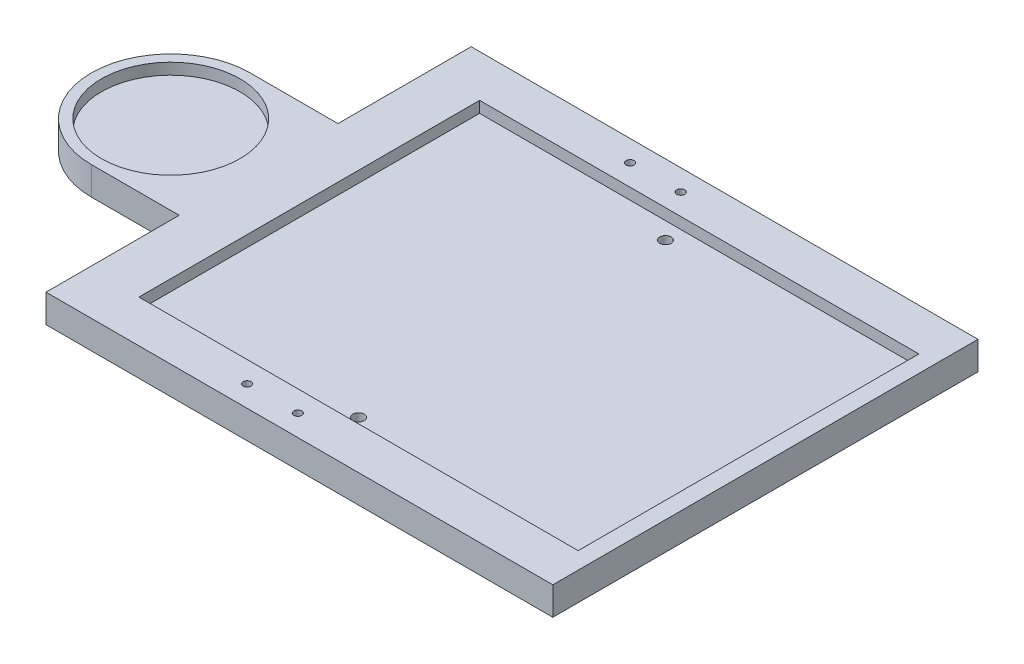
ISO-10303-21;
HEADER;
FILE_DESCRIPTION(('STEP AP214'),'2;1');
FILE_NAME('part.step','',(''),(''),'','','');
FILE_SCHEMA(('AUTOMOTIVE_DESIGN { 1 0 10303 214 1 1 1 1 }'));
ENDSEC;
DATA;
#1=APPLICATION_CONTEXT('core data for automotive mechanical design processes');
#2=APPLICATION_PROTOCOL_DEFINITION('international standard','automotive_design',2000,#1);
#3=PRODUCT_CONTEXT('',#1,'mechanical');
#4=PRODUCT('Part','Part','',(#3));
#5=PRODUCT_RELATED_PRODUCT_CATEGORY('part','',(#4));
#6=PRODUCT_DEFINITION_FORMATION('','',#4);
#7=PRODUCT_DEFINITION_CONTEXT('part definition',#1,'design');
#8=PRODUCT_DEFINITION('design','',#6,#7);
#9=PRODUCT_DEFINITION_SHAPE('','',#8);
#10=(LENGTH_UNIT() NAMED_UNIT(*) SI_UNIT(.MILLI.,.METRE.));
#11=(NAMED_UNIT(*) PLANE_ANGLE_UNIT() SI_UNIT($,.RADIAN.));
#12=(NAMED_UNIT(*) SI_UNIT($,.STERADIAN.) SOLID_ANGLE_UNIT());
#13=UNCERTAINTY_MEASURE_WITH_UNIT(LENGTH_MEASURE(1.E-05),#10,'distance_accuracy_value','');
#14=(GEOMETRIC_REPRESENTATION_CONTEXT(3) GLOBAL_UNCERTAINTY_ASSIGNED_CONTEXT((#13)) GLOBAL_UNIT_ASSIGNED_CONTEXT((#10,
#11,#12)) REPRESENTATION_CONTEXT('',''));
#15=CARTESIAN_POINT('',(0.,0.,0.));
#16=DIRECTION('',(0.,0.,1.));
#17=DIRECTION('',(1.,0.,0.));
#18=AXIS2_PLACEMENT_3D('',#15,#16,#17);
#19=CARTESIAN_POINT('',(0.,25.,0.));
#20=DIRECTION('',(0.,1.,0.));
#21=DIRECTION('',(0.,0.,1.));
#22=AXIS2_PLACEMENT_3D('',#19,#20,#21);
#23=PLANE('',#22);
#24=CARTESIAN_POINT('',(159.81,25.,-170.));
#25=DIRECTION('',(0.,1.,0.));
#26=DIRECTION('',(0.,0.,-1.));
#27=AXIS2_PLACEMENT_3D('',#24,#25,#26);
#28=CIRCLE('',#27,3.49999999999999);
#29=CARTESIAN_POINT('',(159.81,25.,-173.5));
#30=VERTEX_POINT('',#29);
#31=EDGE_CURVE('E563',#30,#30,#28,.T.);
#32=ORIENTED_EDGE('',*,*,#31,.F.);
#33=EDGE_LOOP('',(#32));
#34=FACE_BOUND('',#33,.T.);
#35=CARTESIAN_POINT('',(204.81,25.,-170.));
#36=DIRECTION('',(0.,1.,0.));
#37=DIRECTION('',(0.,0.,-1.));
#38=AXIS2_PLACEMENT_3D('',#35,#36,#37);
#39=CIRCLE('',#38,3.50000000000002);
#40=CARTESIAN_POINT('',(204.81,25.,-173.5));
#41=VERTEX_POINT('',#40);
#42=EDGE_CURVE('E565',#41,#41,#39,.T.);
#43=ORIENTED_EDGE('',*,*,#42,.F.);
#44=EDGE_LOOP('',(#43));
#45=FACE_BOUND('',#44,.T.);
#46=CARTESIAN_POINT('',(204.81,25.,170.));
#47=DIRECTION('',(0.,1.,0.));
#48=DIRECTION('',(0.,0.,1.));
#49=AXIS2_PLACEMENT_3D('',#46,#47,#48);
#50=CIRCLE('',#49,3.50000000000002);
#51=CARTESIAN_POINT('',(204.81,25.,173.5));
#52=VERTEX_POINT('',#51);
#53=EDGE_CURVE('E577',#52,#52,#50,.T.);
#54=ORIENTED_EDGE('',*,*,#53,.F.);
#55=EDGE_LOOP('',(#54));
#56=FACE_BOUND('',#55,.T.);
#57=CARTESIAN_POINT('',(159.81,25.,170.));
#58=DIRECTION('',(0.,1.,0.));
#59=DIRECTION('',(0.,0.,1.));
#60=AXIS2_PLACEMENT_3D('',#57,#58,#59);
#61=CIRCLE('',#60,3.49999999999999);
#62=CARTESIAN_POINT('',(159.81,25.,173.5));
#63=VERTEX_POINT('',#62);
#64=EDGE_CURVE('E571',#63,#63,#61,.T.);
#65=ORIENTED_EDGE('',*,*,#64,.F.);
#66=EDGE_LOOP('',(#65));
#67=FACE_BOUND('',#66,.T.);
#68=DIRECTION('',(0.,0.,-1.));
#69=VECTOR('',#68,1.);
#70=CARTESIAN_POINT('',(45.,25.,151.25));
#71=LINE('',#70,#69);
#72=CARTESIAN_POINT('',(45.,25.,151.25));
#73=VERTEX_POINT('',#72);
#74=CARTESIAN_POINT('',(45.,25.,-151.25));
#75=VERTEX_POINT('',#74);
#76=EDGE_CURVE('E240',#73,#75,#71,.T.);
#77=ORIENTED_EDGE('',*,*,#76,.T.);
#78=DIRECTION('',(-1.,0.,0.));
#79=VECTOR('',#78,1.);
#80=CARTESIAN_POINT('',(435.,25.,-151.25));
#81=LINE('',#80,#79);
#82=CARTESIAN_POINT('',(435.,25.,-151.25));
#83=VERTEX_POINT('',#82);
#84=EDGE_CURVE('E238',#83,#75,#81,.T.);
#85=ORIENTED_EDGE('',*,*,#84,.F.);
#86=DIRECTION('',(0.,0.,-1.));
#87=VECTOR('',#86,1.);
#88=CARTESIAN_POINT('',(435.,25.,151.25));
#89=LINE('',#88,#87);
#90=CARTESIAN_POINT('',(435.,25.,151.25));
#91=VERTEX_POINT('',#90);
#92=EDGE_CURVE('E205',#91,#83,#89,.T.);
#93=ORIENTED_EDGE('',*,*,#92,.F.);
#94=DIRECTION('',(-1.,0.,0.));
#95=VECTOR('',#94,1.);
#96=CARTESIAN_POINT('',(435.,25.,151.25));
#97=LINE('',#96,#95);
#98=EDGE_CURVE('E243',#91,#73,#97,.T.);
#99=ORIENTED_EDGE('',*,*,#98,.T.);
#100=EDGE_LOOP('',(#77,#85,#93,#99));
#101=FACE_BOUND('',#100,.T.);
#102=CARTESIAN_POINT('',(-78.,25.,0.));
#103=DIRECTION('',(0.,1.,0.));
#104=DIRECTION('',(0.,0.,1.));
#105=AXIS2_PLACEMENT_3D('',#102,#103,#104);
#106=CIRCLE('',#105,70.5);
#107=CARTESIAN_POINT('',(-78.,25.,70.5));
#108=VERTEX_POINT('',#107);
#109=CARTESIAN_POINT('',(-78.,25.,-70.5));
#110=VERTEX_POINT('',#109);
#111=EDGE_CURVE('E252',#108,#110,#106,.F.);
#112=ORIENTED_EDGE('',*,*,#111,.F.);
#113=DIRECTION('',(-1.,0.,0.));
#114=VECTOR('',#113,1.);
#115=CARTESIAN_POINT('',(0.,25.,70.5));
#116=LINE('',#115,#114);
#117=CARTESIAN_POINT('',(0.,25.,70.5));
#118=VERTEX_POINT('',#117);
#119=EDGE_CURVE('E255',#118,#108,#116,.T.);
#120=ORIENTED_EDGE('',*,*,#119,.F.);
#121=DIRECTION('',(0.,0.,-1.));
#122=VECTOR('',#121,1.);
#123=CARTESIAN_POINT('',(0.,25.,0.));
#124=LINE('',#123,#122);
#125=CARTESIAN_POINT('',(0.,25.,188.75));
#126=VERTEX_POINT('',#125);
#127=EDGE_CURVE('E258',#126,#118,#124,.T.);
#128=ORIENTED_EDGE('',*,*,#127,.F.);
#129=DIRECTION('',(-1.,0.,0.));
#130=VECTOR('',#129,1.);
#131=CARTESIAN_POINT('',(0.,25.,188.75));
#132=LINE('',#131,#130);
#133=CARTESIAN_POINT('',(450.,25.,188.75));
#134=VERTEX_POINT('',#133);
#135=EDGE_CURVE('E262',#134,#126,#132,.T.);
#136=ORIENTED_EDGE('',*,*,#135,.F.);
#137=DIRECTION('',(0.,0.,1.));
#138=VECTOR('',#137,1.);
#139=CARTESIAN_POINT('',(450.,25.,0.));
#140=LINE('',#139,#138);
#141=CARTESIAN_POINT('',(450.,25.,-188.75));
#142=VERTEX_POINT('',#141);
#143=EDGE_CURVE('E265',#142,#134,#140,.T.);
#144=ORIENTED_EDGE('',*,*,#143,.F.);
#145=DIRECTION('',(1.,0.,0.));
#146=VECTOR('',#145,1.);
#147=CARTESIAN_POINT('',(0.,25.,-188.75));
#148=LINE('',#147,#146);
#149=CARTESIAN_POINT('',(0.,25.,-188.75));
#150=VERTEX_POINT('',#149);
#151=EDGE_CURVE('E268',#150,#142,#148,.T.);
#152=ORIENTED_EDGE('',*,*,#151,.F.);
#153=DIRECTION('',(0.,0.,-1.));
#154=VECTOR('',#153,1.);
#155=CARTESIAN_POINT('',(0.,25.,0.));
#156=LINE('',#155,#154);
#157=CARTESIAN_POINT('',(0.,25.,-70.5));
#158=VERTEX_POINT('',#157);
#159=EDGE_CURVE('E271',#158,#150,#156,.T.);
#160=ORIENTED_EDGE('',*,*,#159,.F.);
#161=DIRECTION('',(1.,0.,0.));
#162=VECTOR('',#161,1.);
#163=CARTESIAN_POINT('',(0.,25.,-70.5));
#164=LINE('',#163,#162);
#165=EDGE_CURVE('E274',#110,#158,#164,.T.);
#166=ORIENTED_EDGE('',*,*,#165,.F.);
#167=EDGE_LOOP('',(#112,#120,#128,#136,#144,#152,#160,#166));
#168=FACE_BOUND('',#167,.T.);
#169=CARTESIAN_POINT('',(-78.,25.,0.));
#170=DIRECTION('',(0.,1.,0.));
#171=DIRECTION('',(0.,0.,1.));
#172=AXIS2_PLACEMENT_3D('',#169,#170,#171);
#173=CIRCLE('',#172,61.5);
#174=CARTESIAN_POINT('',(-78.,25.,61.5));
#175=VERTEX_POINT('',#174);
#176=EDGE_CURVE('E228',#175,#175,#173,.T.);
#177=ORIENTED_EDGE('',*,*,#176,.F.);
#178=EDGE_LOOP('',(#177));
#179=FACE_BOUND('',#178,.T.);
#180=ADVANCED_FACE('F108',(#34,#45,#56,#67,#101,#168,#179),#23,.T.);
#181=CARTESIAN_POINT('',(0.,0.,0.));
#182=DIRECTION('',(0.,1.,0.));
#183=DIRECTION('',(0.,0.,1.));
#184=AXIS2_PLACEMENT_3D('',#181,#182,#183);
#185=PLANE('',#184);
#186=CARTESIAN_POINT('',(159.81,0.,-170.));
#187=DIRECTION('',(0.,1.,0.));
#188=DIRECTION('',(0.,0.,-1.));
#189=AXIS2_PLACEMENT_3D('',#186,#187,#188);
#190=CIRCLE('',#189,3.49999999999999);
#191=CARTESIAN_POINT('',(159.81,0.,-173.5));
#192=VERTEX_POINT('',#191);
#193=EDGE_CURVE('E561',#192,#192,#190,.T.);
#194=ORIENTED_EDGE('',*,*,#193,.T.);
#195=EDGE_LOOP('',(#194));
#196=FACE_BOUND('',#195,.T.);
#197=CARTESIAN_POINT('',(204.81,0.,-170.));
#198=DIRECTION('',(0.,1.,0.));
#199=DIRECTION('',(0.,0.,-1.));
#200=AXIS2_PLACEMENT_3D('',#197,#198,#199);
#201=CIRCLE('',#200,3.50000000000002);
#202=CARTESIAN_POINT('',(204.81,0.,-173.5));
#203=VERTEX_POINT('',#202);
#204=EDGE_CURVE('E582',#203,#203,#201,.T.);
#205=ORIENTED_EDGE('',*,*,#204,.T.);
#206=EDGE_LOOP('',(#205));
#207=FACE_BOUND('',#206,.T.);
#208=CARTESIAN_POINT('',(204.81,0.,170.));
#209=DIRECTION('',(0.,1.,0.));
#210=DIRECTION('',(0.,0.,1.));
#211=AXIS2_PLACEMENT_3D('',#208,#209,#210);
#212=CIRCLE('',#211,3.50000000000002);
#213=CARTESIAN_POINT('',(204.81,0.,173.5));
#214=VERTEX_POINT('',#213);
#215=EDGE_CURVE('E573',#214,#214,#212,.T.);
#216=ORIENTED_EDGE('',*,*,#215,.T.);
#217=EDGE_LOOP('',(#216));
#218=FACE_BOUND('',#217,.T.);
#219=CARTESIAN_POINT('',(159.81,0.,170.));
#220=DIRECTION('',(0.,1.,0.));
#221=DIRECTION('',(0.,0.,1.));
#222=AXIS2_PLACEMENT_3D('',#219,#220,#221);
#223=CIRCLE('',#222,3.49999999999999);
#224=CARTESIAN_POINT('',(159.81,0.,173.5));
#225=VERTEX_POINT('',#224);
#226=EDGE_CURVE('E233',#225,#225,#223,.T.);
#227=ORIENTED_EDGE('',*,*,#226,.T.);
#228=EDGE_LOOP('',(#227));
#229=FACE_BOUND('',#228,.T.);
#230=CARTESIAN_POINT('',(-78.,0.,0.));
#231=DIRECTION('',(0.,1.,0.));
#232=DIRECTION('',(0.,0.,1.));
#233=AXIS2_PLACEMENT_3D('',#230,#231,#232);
#234=CIRCLE('',#233,70.5);
#235=CARTESIAN_POINT('',(-78.,0.,70.5));
#236=VERTEX_POINT('',#235);
#237=CARTESIAN_POINT('',(-78.,0.,-70.5));
#238=VERTEX_POINT('',#237);
#239=EDGE_CURVE('E251',#236,#238,#234,.F.);
#240=ORIENTED_EDGE('',*,*,#239,.T.);
#241=DIRECTION('',(1.,0.,0.));
#242=VECTOR('',#241,1.);
#243=CARTESIAN_POINT('',(0.,0.,-70.5));
#244=LINE('',#243,#242);
#245=CARTESIAN_POINT('',(0.,0.,-70.5));
#246=VERTEX_POINT('',#245);
#247=EDGE_CURVE('E256',#238,#246,#244,.T.);
#248=ORIENTED_EDGE('',*,*,#247,.T.);
#249=DIRECTION('',(0.,0.,-1.));
#250=VECTOR('',#249,1.);
#251=CARTESIAN_POINT('',(0.,0.,0.));
#252=LINE('',#251,#250);
#253=CARTESIAN_POINT('',(0.,0.,-188.75));
#254=VERTEX_POINT('',#253);
#255=EDGE_CURVE('E295',#246,#254,#252,.T.);
#256=ORIENTED_EDGE('',*,*,#255,.T.);
#257=DIRECTION('',(1.,0.,0.));
#258=VECTOR('',#257,1.);
#259=CARTESIAN_POINT('',(0.,0.,-188.75));
#260=LINE('',#259,#258);
#261=CARTESIAN_POINT('',(450.,0.,-188.75));
#262=VERTEX_POINT('',#261);
#263=EDGE_CURVE('E292',#254,#262,#260,.T.);
#264=ORIENTED_EDGE('',*,*,#263,.T.);
#265=DIRECTION('',(0.,0.,1.));
#266=VECTOR('',#265,1.);
#267=CARTESIAN_POINT('',(450.,0.,0.));
#268=LINE('',#267,#266);
#269=CARTESIAN_POINT('',(450.,0.,188.75));
#270=VERTEX_POINT('',#269);
#271=EDGE_CURVE('E289',#262,#270,#268,.T.);
#272=ORIENTED_EDGE('',*,*,#271,.T.);
#273=DIRECTION('',(-1.,0.,0.));
#274=VECTOR('',#273,1.);
#275=CARTESIAN_POINT('',(0.,0.,188.75));
#276=LINE('',#275,#274);
#277=CARTESIAN_POINT('',(0.,0.,188.75));
#278=VERTEX_POINT('',#277);
#279=EDGE_CURVE('E286',#270,#278,#276,.T.);
#280=ORIENTED_EDGE('',*,*,#279,.T.);
#281=DIRECTION('',(0.,0.,-1.));
#282=VECTOR('',#281,1.);
#283=CARTESIAN_POINT('',(0.,0.,0.));
#284=LINE('',#283,#282);
#285=CARTESIAN_POINT('',(0.,0.,70.5));
#286=VERTEX_POINT('',#285);
#287=EDGE_CURVE('E283',#278,#286,#284,.T.);
#288=ORIENTED_EDGE('',*,*,#287,.T.);
#289=DIRECTION('',(-1.,0.,0.));
#290=VECTOR('',#289,1.);
#291=CARTESIAN_POINT('',(0.,0.,70.5));
#292=LINE('',#291,#290);
#293=EDGE_CURVE('E280',#286,#236,#292,.T.);
#294=ORIENTED_EDGE('',*,*,#293,.T.);
#295=EDGE_LOOP('',(#240,#248,#256,#264,#272,#280,#288,#294));
#296=FACE_BOUND('',#295,.T.);
#297=CARTESIAN_POINT('',(225.,0.,-136.25));
#298=DIRECTION('',(0.,1.,0.));
#299=DIRECTION('',(0.,0.,1.));
#300=AXIS2_PLACEMENT_3D('',#297,#298,#299);
#301=CIRCLE('',#300,5.00000000000002);
#302=CARTESIAN_POINT('',(225.,0.,-131.25));
#303=VERTEX_POINT('',#302);
#304=EDGE_CURVE('E229',#303,#303,#301,.T.);
#305=ORIENTED_EDGE('',*,*,#304,.T.);
#306=EDGE_LOOP('',(#305));
#307=FACE_BOUND('',#306,.T.);
#308=CARTESIAN_POINT('',(225.,0.,136.25));
#309=DIRECTION('',(0.,1.,0.));
#310=DIRECTION('',(0.,0.,1.));
#311=AXIS2_PLACEMENT_3D('',#308,#309,#310);
#312=CIRCLE('',#311,5.00000000000002);
#313=CARTESIAN_POINT('',(225.,0.,141.25));
#314=VERTEX_POINT('',#313);
#315=EDGE_CURVE('E232',#314,#314,#312,.F.);
#316=ORIENTED_EDGE('',*,*,#315,.F.);
#317=EDGE_LOOP('',(#316));
#318=FACE_BOUND('',#317,.T.);
#319=ADVANCED_FACE('F321',(#196,#207,#218,#229,#296,#307,#318),#185,.F.);
#320=CARTESIAN_POINT('',(-78.,25.,0.));
#321=DIRECTION('',(0.,-1.,0.));
#322=DIRECTION('',(0.,0.,-1.));
#323=AXIS2_PLACEMENT_3D('',#320,#321,#322);
#324=CYLINDRICAL_SURFACE('',#323,70.5);
#325=ORIENTED_EDGE('',*,*,#239,.F.);
#326=DIRECTION('',(0.,-1.,0.));
#327=VECTOR('',#326,1.);
#328=CARTESIAN_POINT('',(-78.,25.,70.5));
#329=LINE('',#328,#327);
#330=EDGE_CURVE('E116',#108,#236,#329,.T.);
#331=ORIENTED_EDGE('',*,*,#330,.F.);
#332=ORIENTED_EDGE('',*,*,#111,.T.);
#333=DIRECTION('',(0.,-1.,0.));
#334=VECTOR('',#333,1.);
#335=CARTESIAN_POINT('',(-78.,25.,-70.5));
#336=LINE('',#335,#334);
#337=EDGE_CURVE('E277',#110,#238,#336,.T.);
#338=ORIENTED_EDGE('',*,*,#337,.T.);
#339=EDGE_LOOP('',(#325,#331,#332,#338));
#340=FACE_BOUND('',#339,.T.);
#341=ADVANCED_FACE('F110',(#340),#324,.T.);
#342=CARTESIAN_POINT('',(0.,25.,70.5));
#343=DIRECTION('',(0.,0.,1.));
#344=DIRECTION('',(1.,0.,0.));
#345=AXIS2_PLACEMENT_3D('',#342,#343,#344);
#346=PLANE('',#345);
#347=ORIENTED_EDGE('',*,*,#293,.F.);
#348=DIRECTION('',(0.,-1.,0.));
#349=VECTOR('',#348,1.);
#350=CARTESIAN_POINT('',(0.,25.,70.5));
#351=LINE('',#350,#349);
#352=EDGE_CURVE('E311',#118,#286,#351,.T.);
#353=ORIENTED_EDGE('',*,*,#352,.F.);
#354=ORIENTED_EDGE('',*,*,#119,.T.);
#355=ORIENTED_EDGE('',*,*,#330,.T.);
#356=EDGE_LOOP('',(#347,#353,#354,#355));
#357=FACE_BOUND('',#356,.T.);
#358=ADVANCED_FACE('F315',(#357),#346,.T.);
#359=CARTESIAN_POINT('',(0.,25.,0.));
#360=DIRECTION('',(-1.,0.,0.));
#361=DIRECTION('',(0.,0.,1.));
#362=AXIS2_PLACEMENT_3D('',#359,#360,#361);
#363=PLANE('',#362);
#364=ORIENTED_EDGE('',*,*,#287,.F.);
#365=DIRECTION('',(0.,-1.,0.));
#366=VECTOR('',#365,1.);
#367=CARTESIAN_POINT('',(0.,25.,188.75));
#368=LINE('',#367,#366);
#369=EDGE_CURVE('E309',#126,#278,#368,.T.);
#370=ORIENTED_EDGE('',*,*,#369,.F.);
#371=ORIENTED_EDGE('',*,*,#127,.T.);
#372=ORIENTED_EDGE('',*,*,#352,.T.);
#373=EDGE_LOOP('',(#364,#370,#371,#372));
#374=FACE_BOUND('',#373,.T.);
#375=ADVANCED_FACE('F326',(#374),#363,.T.);
#376=CARTESIAN_POINT('',(0.,25.,188.75));
#377=DIRECTION('',(0.,0.,1.));
#378=DIRECTION('',(1.,0.,0.));
#379=AXIS2_PLACEMENT_3D('',#376,#377,#378);
#380=PLANE('',#379);
#381=ORIENTED_EDGE('',*,*,#279,.F.);
#382=DIRECTION('',(0.,-1.,0.));
#383=VECTOR('',#382,1.);
#384=CARTESIAN_POINT('',(450.,25.,188.75));
#385=LINE('',#384,#383);
#386=EDGE_CURVE('E307',#134,#270,#385,.T.);
#387=ORIENTED_EDGE('',*,*,#386,.F.);
#388=ORIENTED_EDGE('',*,*,#135,.T.);
#389=ORIENTED_EDGE('',*,*,#369,.T.);
#390=EDGE_LOOP('',(#381,#387,#388,#389));
#391=FACE_BOUND('',#390,.T.);
#392=ADVANCED_FACE('F347',(#391),#380,.T.);
#393=CARTESIAN_POINT('',(450.,25.,0.));
#394=DIRECTION('',(1.,0.,0.));
#395=DIRECTION('',(0.,0.,-1.));
#396=AXIS2_PLACEMENT_3D('',#393,#394,#395);
#397=PLANE('',#396);
#398=ORIENTED_EDGE('',*,*,#271,.F.);
#399=DIRECTION('',(0.,-1.,0.));
#400=VECTOR('',#399,1.);
#401=CARTESIAN_POINT('',(450.,25.,-188.75));
#402=LINE('',#401,#400);
#403=EDGE_CURVE('E305',#142,#262,#402,.T.);
#404=ORIENTED_EDGE('',*,*,#403,.F.);
#405=ORIENTED_EDGE('',*,*,#143,.T.);
#406=ORIENTED_EDGE('',*,*,#386,.T.);
#407=EDGE_LOOP('',(#398,#404,#405,#406));
#408=FACE_BOUND('',#407,.T.);
#409=ADVANCED_FACE('F345',(#408),#397,.T.);
#410=CARTESIAN_POINT('',(0.,25.,-188.75));
#411=DIRECTION('',(0.,0.,-1.));
#412=DIRECTION('',(-1.,0.,0.));
#413=AXIS2_PLACEMENT_3D('',#410,#411,#412);
#414=PLANE('',#413);
#415=ORIENTED_EDGE('',*,*,#263,.F.);
#416=DIRECTION('',(0.,-1.,0.));
#417=VECTOR('',#416,1.);
#418=CARTESIAN_POINT('',(0.,25.,-188.75));
#419=LINE('',#418,#417);
#420=EDGE_CURVE('E303',#150,#254,#419,.T.);
#421=ORIENTED_EDGE('',*,*,#420,.F.);
#422=ORIENTED_EDGE('',*,*,#151,.T.);
#423=ORIENTED_EDGE('',*,*,#403,.T.);
#424=EDGE_LOOP('',(#415,#421,#422,#423));
#425=FACE_BOUND('',#424,.T.);
#426=ADVANCED_FACE('F341',(#425),#414,.T.);
#427=CARTESIAN_POINT('',(0.,25.,0.));
#428=DIRECTION('',(-1.,0.,0.));
#429=DIRECTION('',(0.,0.,1.));
#430=AXIS2_PLACEMENT_3D('',#427,#428,#429);
#431=PLANE('',#430);
#432=ORIENTED_EDGE('',*,*,#255,.F.);
#433=DIRECTION('',(0.,-1.,0.));
#434=VECTOR('',#433,1.);
#435=CARTESIAN_POINT('',(0.,25.,-70.5));
#436=LINE('',#435,#434);
#437=EDGE_CURVE('E301',#158,#246,#436,.T.);
#438=ORIENTED_EDGE('',*,*,#437,.F.);
#439=ORIENTED_EDGE('',*,*,#159,.T.);
#440=ORIENTED_EDGE('',*,*,#420,.T.);
#441=EDGE_LOOP('',(#432,#438,#439,#440));
#442=FACE_BOUND('',#441,.T.);
#443=ADVANCED_FACE('F339',(#442),#431,.T.);
#444=CARTESIAN_POINT('',(0.,25.,-70.5));
#445=DIRECTION('',(0.,0.,-1.));
#446=DIRECTION('',(-1.,0.,0.));
#447=AXIS2_PLACEMENT_3D('',#444,#445,#446);
#448=PLANE('',#447);
#449=ORIENTED_EDGE('',*,*,#247,.F.);
#450=ORIENTED_EDGE('',*,*,#337,.F.);
#451=ORIENTED_EDGE('',*,*,#165,.T.);
#452=ORIENTED_EDGE('',*,*,#437,.T.);
#453=EDGE_LOOP('',(#449,#450,#451,#452));
#454=FACE_BOUND('',#453,.T.);
#455=ADVANCED_FACE('F335',(#454),#448,.T.);
#456=CARTESIAN_POINT('',(435.,25.,-151.25));
#457=DIRECTION('',(0.,0.,1.));
#458=DIRECTION('',(1.,0.,0.));
#459=AXIS2_PLACEMENT_3D('',#456,#457,#458);
#460=PLANE('',#459);
#461=DIRECTION('',(-1.,0.,0.));
#462=VECTOR('',#461,1.);
#463=CARTESIAN_POINT('',(0.,15.,-151.25));
#464=LINE('',#463,#462);
#465=CARTESIAN_POINT('',(435.,15.,-151.25));
#466=VERTEX_POINT('',#465);
#467=CARTESIAN_POINT('',(45.,15.,-151.25));
#468=VERTEX_POINT('',#467);
#469=EDGE_CURVE('E211',#466,#468,#464,.T.);
#470=ORIENTED_EDGE('',*,*,#469,.F.);
#471=DIRECTION('',(0.,-1.,0.));
#472=VECTOR('',#471,1.);
#473=CARTESIAN_POINT('',(435.,25.,-151.25));
#474=LINE('',#473,#472);
#475=EDGE_CURVE('E198',#83,#466,#474,.T.);
#476=ORIENTED_EDGE('',*,*,#475,.F.);
#477=ORIENTED_EDGE('',*,*,#84,.T.);
#478=DIRECTION('',(0.,-1.,0.));
#479=VECTOR('',#478,1.);
#480=CARTESIAN_POINT('',(45.,25.,-151.25));
#481=LINE('',#480,#479);
#482=EDGE_CURVE('E213',#75,#468,#481,.T.);
#483=ORIENTED_EDGE('',*,*,#482,.T.);
#484=EDGE_LOOP('',(#470,#476,#477,#483));
#485=FACE_BOUND('',#484,.T.);
#486=ADVANCED_FACE('F212',(#485),#460,.T.);
#487=CARTESIAN_POINT('',(45.,25.,151.25));
#488=DIRECTION('',(-1.,0.,0.));
#489=DIRECTION('',(0.,0.,1.));
#490=AXIS2_PLACEMENT_3D('',#487,#488,#489);
#491=PLANE('',#490);
#492=DIRECTION('',(0.,-1.,0.));
#493=VECTOR('',#492,1.);
#494=CARTESIAN_POINT('',(45.,25.,151.25));
#495=LINE('',#494,#493);
#496=CARTESIAN_POINT('',(45.,15.,151.25));
#497=VERTEX_POINT('',#496);
#498=EDGE_CURVE('E248',#73,#497,#495,.T.);
#499=ORIENTED_EDGE('',*,*,#498,.T.);
#500=DIRECTION('',(0.,0.,-1.));
#501=VECTOR('',#500,1.);
#502=CARTESIAN_POINT('',(45.,15.,0.));
#503=LINE('',#502,#501);
#504=EDGE_CURVE('E123',#497,#468,#503,.T.);
#505=ORIENTED_EDGE('',*,*,#504,.T.);
#506=ORIENTED_EDGE('',*,*,#482,.F.);
#507=ORIENTED_EDGE('',*,*,#76,.F.);
#508=EDGE_LOOP('',(#499,#505,#506,#507));
#509=FACE_BOUND('',#508,.T.);
#510=ADVANCED_FACE('F393',(#509),#491,.F.);
#511=CARTESIAN_POINT('',(435.,25.,151.25));
#512=DIRECTION('',(0.,0.,1.));
#513=DIRECTION('',(1.,0.,0.));
#514=AXIS2_PLACEMENT_3D('',#511,#512,#513);
#515=PLANE('',#514);
#516=DIRECTION('',(0.,-1.,0.));
#517=VECTOR('',#516,1.);
#518=CARTESIAN_POINT('',(435.,25.,151.25));
#519=LINE('',#518,#517);
#520=CARTESIAN_POINT('',(435.,15.,151.25));
#521=VERTEX_POINT('',#520);
#522=EDGE_CURVE('E208',#91,#521,#519,.T.);
#523=ORIENTED_EDGE('',*,*,#522,.T.);
#524=DIRECTION('',(-1.,0.,0.));
#525=VECTOR('',#524,1.);
#526=CARTESIAN_POINT('',(0.,15.,151.25));
#527=LINE('',#526,#525);
#528=EDGE_CURVE('E131',#521,#497,#527,.T.);
#529=ORIENTED_EDGE('',*,*,#528,.T.);
#530=ORIENTED_EDGE('',*,*,#498,.F.);
#531=ORIENTED_EDGE('',*,*,#98,.F.);
#532=EDGE_LOOP('',(#523,#529,#530,#531));
#533=FACE_BOUND('',#532,.T.);
#534=ADVANCED_FACE('F399',(#533),#515,.F.);
#535=CARTESIAN_POINT('',(435.,25.,151.25));
#536=DIRECTION('',(-1.,0.,0.));
#537=DIRECTION('',(0.,0.,1.));
#538=AXIS2_PLACEMENT_3D('',#535,#536,#537);
#539=PLANE('',#538);
#540=DIRECTION('',(0.,0.,-1.));
#541=VECTOR('',#540,1.);
#542=CARTESIAN_POINT('',(435.,15.,0.));
#543=LINE('',#542,#541);
#544=EDGE_CURVE('E203',#521,#466,#543,.T.);
#545=ORIENTED_EDGE('',*,*,#544,.F.);
#546=ORIENTED_EDGE('',*,*,#522,.F.);
#547=ORIENTED_EDGE('',*,*,#92,.T.);
#548=ORIENTED_EDGE('',*,*,#475,.T.);
#549=EDGE_LOOP('',(#545,#546,#547,#548));
#550=FACE_BOUND('',#549,.T.);
#551=ADVANCED_FACE('F200',(#550),#539,.T.);
#552=CARTESIAN_POINT('',(-78.,25.,0.));
#553=DIRECTION('',(0.,-1.,0.));
#554=DIRECTION('',(0.,0.,-1.));
#555=AXIS2_PLACEMENT_3D('',#552,#553,#554);
#556=CYLINDRICAL_SURFACE('',#555,61.5);
#557=CARTESIAN_POINT('',(-78.,15.,0.));
#558=DIRECTION('',(0.,1.,0.));
#559=DIRECTION('',(0.,0.,1.));
#560=AXIS2_PLACEMENT_3D('',#557,#558,#559);
#561=CIRCLE('',#560,61.5);
#562=CARTESIAN_POINT('',(-78.,15.,61.5));
#563=VERTEX_POINT('',#562);
#564=EDGE_CURVE('E13',#563,#563,#561,.T.);
#565=ORIENTED_EDGE('',*,*,#564,.F.);
#566=EDGE_LOOP('',(#565));
#567=FACE_BOUND('',#566,.T.);
#568=ORIENTED_EDGE('',*,*,#176,.T.);
#569=EDGE_LOOP('',(#568));
#570=FACE_BOUND('',#569,.T.);
#571=ADVANCED_FACE('F411',(#567,#570),#556,.F.);
#572=CARTESIAN_POINT('',(225.,15.,-136.25));
#573=DIRECTION('',(0.,-1.,0.));
#574=DIRECTION('',(0.,0.,-1.));
#575=AXIS2_PLACEMENT_3D('',#572,#573,#574);
#576=CYLINDRICAL_SURFACE('',#575,5.00000000000002);
#577=CARTESIAN_POINT('',(225.,15.,-136.25));
#578=DIRECTION('',(0.,1.,0.));
#579=DIRECTION('',(0.,0.,1.));
#580=AXIS2_PLACEMENT_3D('',#577,#578,#579);
#581=CIRCLE('',#580,5.00000000000002);
#582=CARTESIAN_POINT('',(225.,15.,-131.25));
#583=VERTEX_POINT('',#582);
#584=EDGE_CURVE('E215',#583,#583,#581,.T.);
#585=ORIENTED_EDGE('',*,*,#584,.T.);
#586=EDGE_LOOP('',(#585));
#587=FACE_BOUND('',#586,.T.);
#588=ORIENTED_EDGE('',*,*,#304,.F.);
#589=EDGE_LOOP('',(#588));
#590=FACE_BOUND('',#589,.T.);
#591=ADVANCED_FACE('F418',(#587,#590),#576,.F.);
#592=CARTESIAN_POINT('',(225.,15.,136.25));
#593=DIRECTION('',(0.,-1.,0.));
#594=DIRECTION('',(0.,0.,-1.));
#595=AXIS2_PLACEMENT_3D('',#592,#593,#594);
#596=CYLINDRICAL_SURFACE('',#595,5.00000000000002);
#597=CARTESIAN_POINT('',(225.,15.,136.25));
#598=DIRECTION('',(0.,1.,0.));
#599=DIRECTION('',(0.,0.,1.));
#600=AXIS2_PLACEMENT_3D('',#597,#598,#599);
#601=CIRCLE('',#600,5.00000000000002);
#602=CARTESIAN_POINT('',(225.,15.,141.25));
#603=VERTEX_POINT('',#602);
#604=EDGE_CURVE('E225',#603,#603,#601,.F.);
#605=ORIENTED_EDGE('',*,*,#604,.F.);
#606=EDGE_LOOP('',(#605));
#607=FACE_BOUND('',#606,.T.);
#608=ORIENTED_EDGE('',*,*,#315,.T.);
#609=EDGE_LOOP('',(#608));
#610=FACE_BOUND('',#609,.T.);
#611=ADVANCED_FACE('F426',(#607,#610),#596,.F.);
#612=CARTESIAN_POINT('',(0.,15.,0.));
#613=DIRECTION('',(0.,1.,0.));
#614=DIRECTION('',(0.,0.,1.));
#615=AXIS2_PLACEMENT_3D('',#612,#613,#614);
#616=PLANE('',#615);
#617=ORIENTED_EDGE('',*,*,#504,.F.);
#618=ORIENTED_EDGE('',*,*,#528,.F.);
#619=ORIENTED_EDGE('',*,*,#544,.T.);
#620=ORIENTED_EDGE('',*,*,#469,.T.);
#621=EDGE_LOOP('',(#617,#618,#619,#620));
#622=FACE_BOUND('',#621,.T.);
#623=ORIENTED_EDGE('',*,*,#584,.F.);
#624=EDGE_LOOP('',(#623));
#625=FACE_BOUND('',#624,.T.);
#626=ORIENTED_EDGE('',*,*,#604,.T.);
#627=EDGE_LOOP('',(#626));
#628=FACE_BOUND('',#627,.T.);
#629=ADVANCED_FACE('F217',(#622,#625,#628),#616,.T.);
#630=CARTESIAN_POINT('',(0.,15.,0.));
#631=DIRECTION('',(0.,1.,0.));
#632=DIRECTION('',(0.,0.,1.));
#633=AXIS2_PLACEMENT_3D('',#630,#631,#632);
#634=PLANE('',#633);
#635=ORIENTED_EDGE('',*,*,#564,.T.);
#636=EDGE_LOOP('',(#635));
#637=FACE_BOUND('',#636,.T.);
#638=ADVANCED_FACE('F441',(#637),#634,.T.);
#639=CARTESIAN_POINT('',(159.81,0.,170.));
#640=DIRECTION('',(0.,1.,0.));
#641=DIRECTION('',(0.,0.,1.));
#642=AXIS2_PLACEMENT_3D('',#639,#640,#641);
#643=CYLINDRICAL_SURFACE('',#642,3.49999999999999);
#644=ORIENTED_EDGE('',*,*,#226,.F.);
#645=EDGE_LOOP('',(#644));
#646=FACE_BOUND('',#645,.T.);
#647=ORIENTED_EDGE('',*,*,#64,.T.);
#648=EDGE_LOOP('',(#647));
#649=FACE_BOUND('',#648,.T.);
#650=ADVANCED_FACE('F447',(#646,#649),#643,.F.);
#651=CARTESIAN_POINT('',(204.81,0.,170.));
#652=DIRECTION('',(0.,1.,0.));
#653=DIRECTION('',(0.,0.,1.));
#654=AXIS2_PLACEMENT_3D('',#651,#652,#653);
#655=CYLINDRICAL_SURFACE('',#654,3.50000000000002);
#656=ORIENTED_EDGE('',*,*,#215,.F.);
#657=EDGE_LOOP('',(#656));
#658=FACE_BOUND('',#657,.T.);
#659=ORIENTED_EDGE('',*,*,#53,.T.);
#660=EDGE_LOOP('',(#659));
#661=FACE_BOUND('',#660,.T.);
#662=ADVANCED_FACE('F455',(#658,#661),#655,.F.);
#663=CARTESIAN_POINT('',(204.81,0.,-170.));
#664=DIRECTION('',(0.,1.,0.));
#665=DIRECTION('',(0.,0.,1.));
#666=AXIS2_PLACEMENT_3D('',#663,#664,#665);
#667=CYLINDRICAL_SURFACE('',#666,3.50000000000002);
#668=ORIENTED_EDGE('',*,*,#204,.F.);
#669=EDGE_LOOP('',(#668));
#670=FACE_BOUND('',#669,.T.);
#671=ORIENTED_EDGE('',*,*,#42,.T.);
#672=EDGE_LOOP('',(#671));
#673=FACE_BOUND('',#672,.T.);
#674=ADVANCED_FACE('F463',(#670,#673),#667,.F.);
#675=CARTESIAN_POINT('',(159.81,0.,-170.));
#676=DIRECTION('',(0.,1.,0.));
#677=DIRECTION('',(0.,0.,1.));
#678=AXIS2_PLACEMENT_3D('',#675,#676,#677);
#679=CYLINDRICAL_SURFACE('',#678,3.49999999999999);
#680=ORIENTED_EDGE('',*,*,#193,.F.);
#681=EDGE_LOOP('',(#680));
#682=FACE_BOUND('',#681,.T.);
#683=ORIENTED_EDGE('',*,*,#31,.T.);
#684=EDGE_LOOP('',(#683));
#685=FACE_BOUND('',#684,.T.);
#686=ADVANCED_FACE('F471',(#682,#685),#679,.F.);
#687=CLOSED_SHELL('',(#180,#319,#341,#358,#375,#392,#409,#426,#443,#455,#486,#510,#534,#551,
#571,#591,#611,#629,#638,#650,#662,#674,#686));
#688=MANIFOLD_SOLID_BREP('B2',#687);
#689=ADVANCED_BREP_SHAPE_REPRESENTATION('',(#18,#688),#14);
#690=SHAPE_DEFINITION_REPRESENTATION(#9,#689);
ENDSEC;
END-ISO-10303-21;
